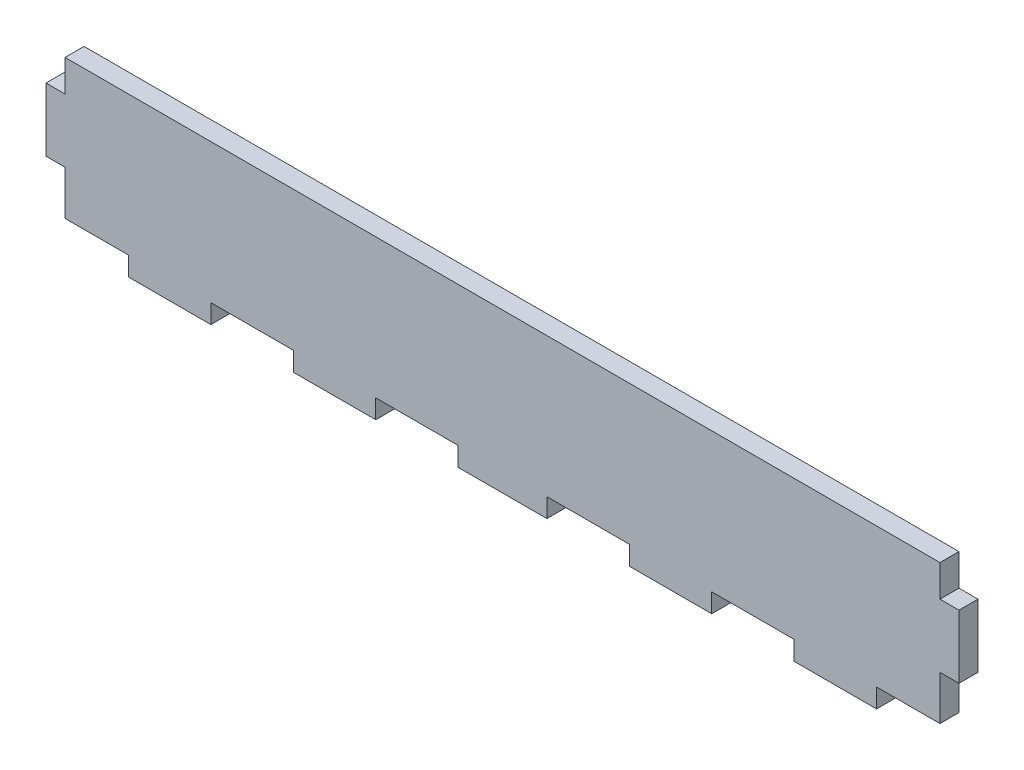
ISO-10303-21;
HEADER;
FILE_DESCRIPTION(('STEP AP214'),'2;1');
FILE_NAME('part.step','',(''),(''),'','','');
FILE_SCHEMA(('AUTOMOTIVE_DESIGN { 1 0 10303 214 1 1 1 1 }'));
ENDSEC;
DATA;
#1=APPLICATION_CONTEXT('core data for automotive mechanical design processes');
#2=APPLICATION_PROTOCOL_DEFINITION('international standard','automotive_design',2000,#1);
#3=PRODUCT_CONTEXT('',#1,'mechanical');
#4=PRODUCT('Part','Part','',(#3));
#5=PRODUCT_RELATED_PRODUCT_CATEGORY('part','',(#4));
#6=PRODUCT_DEFINITION_FORMATION('','',#4);
#7=PRODUCT_DEFINITION_CONTEXT('part definition',#1,'design');
#8=PRODUCT_DEFINITION('design','',#6,#7);
#9=PRODUCT_DEFINITION_SHAPE('','',#8);
#10=(LENGTH_UNIT() NAMED_UNIT(*) SI_UNIT(.MILLI.,.METRE.));
#11=(NAMED_UNIT(*) PLANE_ANGLE_UNIT() SI_UNIT($,.RADIAN.));
#12=(NAMED_UNIT(*) SI_UNIT($,.STERADIAN.) SOLID_ANGLE_UNIT());
#13=UNCERTAINTY_MEASURE_WITH_UNIT(LENGTH_MEASURE(1.E-05),#10,'distance_accuracy_value','');
#14=(GEOMETRIC_REPRESENTATION_CONTEXT(3) GLOBAL_UNCERTAINTY_ASSIGNED_CONTEXT((#13)) GLOBAL_UNIT_ASSIGNED_CONTEXT((#10,
#11,#12)) REPRESENTATION_CONTEXT('',''));
#15=CARTESIAN_POINT('',(0.,0.,0.));
#16=DIRECTION('',(0.,0.,1.));
#17=DIRECTION('',(1.,0.,0.));
#18=AXIS2_PLACEMENT_3D('',#15,#16,#17);
#19=CARTESIAN_POINT('',(0.,0.,3.));
#20=DIRECTION('',(1.,0.,0.));
#21=DIRECTION('',(0.,0.,-1.));
#22=AXIS2_PLACEMENT_3D('',#19,#20,#21);
#23=PLANE('',#22);
#24=DIRECTION('',(0.,-1.,0.));
#25=VECTOR('',#24,1.);
#26=CARTESIAN_POINT('',(0.,0.,0.));
#27=LINE('',#26,#25);
#28=CARTESIAN_POINT('',(0.,7.,0.));
#29=VERTEX_POINT('',#28);
#30=CARTESIAN_POINT('',(0.,0.,0.));
#31=VERTEX_POINT('',#30);
#32=EDGE_CURVE('E272',#29,#31,#27,.T.);
#33=ORIENTED_EDGE('',*,*,#32,.T.);
#34=DIRECTION('',(0.,0.,-1.));
#35=VECTOR('',#34,1.);
#36=CARTESIAN_POINT('',(0.,0.,3.));
#37=LINE('',#36,#35);
#38=CARTESIAN_POINT('',(0.,0.,3.));
#39=VERTEX_POINT('',#38);
#40=EDGE_CURVE('E11',#39,#31,#37,.T.);
#41=ORIENTED_EDGE('',*,*,#40,.F.);
#42=DIRECTION('',(0.,-1.,0.));
#43=VECTOR('',#42,1.);
#44=CARTESIAN_POINT('',(0.,0.,3.));
#45=LINE('',#44,#43);
#46=CARTESIAN_POINT('',(0.,7.,3.));
#47=VERTEX_POINT('',#46);
#48=EDGE_CURVE('E334',#47,#39,#45,.T.);
#49=ORIENTED_EDGE('',*,*,#48,.F.);
#50=DIRECTION('',(0.,0.,-1.));
#51=VECTOR('',#50,1.);
#52=CARTESIAN_POINT('',(0.,7.,3.));
#53=LINE('',#52,#51);
#54=EDGE_CURVE('E268',#47,#29,#53,.T.);
#55=ORIENTED_EDGE('',*,*,#54,.T.);
#56=EDGE_LOOP('',(#33,#41,#49,#55));
#57=FACE_BOUND('',#56,.T.);
#58=ADVANCED_FACE('F32',(#57),#23,.F.);
#59=CARTESIAN_POINT('',(0.,0.,3.));
#60=DIRECTION('',(0.,1.,0.));
#61=DIRECTION('',(0.,0.,1.));
#62=AXIS2_PLACEMENT_3D('',#59,#60,#61);
#63=PLANE('',#62);
#64=DIRECTION('',(1.,0.,0.));
#65=VECTOR('',#64,1.);
#66=CARTESIAN_POINT('',(0.,0.,0.));
#67=LINE('',#66,#65);
#68=CARTESIAN_POINT('',(10.,0.,0.));
#69=VERTEX_POINT('',#68);
#70=EDGE_CURVE('E275',#31,#69,#67,.T.);
#71=ORIENTED_EDGE('',*,*,#70,.T.);
#72=DIRECTION('',(0.,0.,-1.));
#73=VECTOR('',#72,1.);
#74=CARTESIAN_POINT('',(10.,0.,3.));
#75=LINE('',#74,#73);
#76=CARTESIAN_POINT('',(10.,0.,3.));
#77=VERTEX_POINT('',#76);
#78=EDGE_CURVE('E40',#77,#69,#75,.T.);
#79=ORIENTED_EDGE('',*,*,#78,.F.);
#80=DIRECTION('',(1.,0.,0.));
#81=VECTOR('',#80,1.);
#82=CARTESIAN_POINT('',(0.,0.,3.));
#83=LINE('',#82,#81);
#84=EDGE_CURVE('E163',#39,#77,#83,.T.);
#85=ORIENTED_EDGE('',*,*,#84,.F.);
#86=ORIENTED_EDGE('',*,*,#40,.T.);
#87=EDGE_LOOP('',(#71,#79,#85,#86));
#88=FACE_BOUND('',#87,.T.);
#89=ADVANCED_FACE('F512',(#88),#63,.F.);
#90=CARTESIAN_POINT('',(10.,0.,3.));
#91=DIRECTION('',(1.,0.,0.));
#92=DIRECTION('',(0.,0.,-1.));
#93=AXIS2_PLACEMENT_3D('',#90,#91,#92);
#94=PLANE('',#93);
#95=DIRECTION('',(0.,-1.,0.));
#96=VECTOR('',#95,1.);
#97=CARTESIAN_POINT('',(10.,0.,0.));
#98=LINE('',#97,#96);
#99=CARTESIAN_POINT('',(10.,-3.,0.));
#100=VERTEX_POINT('',#99);
#101=EDGE_CURVE('E277',#69,#100,#98,.T.);
#102=ORIENTED_EDGE('',*,*,#101,.T.);
#103=DIRECTION('',(0.,0.,-1.));
#104=VECTOR('',#103,1.);
#105=CARTESIAN_POINT('',(10.,-3.,3.));
#106=LINE('',#105,#104);
#107=CARTESIAN_POINT('',(10.,-3.,3.));
#108=VERTEX_POINT('',#107);
#109=EDGE_CURVE('E413',#108,#100,#106,.T.);
#110=ORIENTED_EDGE('',*,*,#109,.F.);
#111=DIRECTION('',(0.,-1.,0.));
#112=VECTOR('',#111,1.);
#113=CARTESIAN_POINT('',(10.,0.,3.));
#114=LINE('',#113,#112);
#115=EDGE_CURVE('E421',#77,#108,#114,.T.);
#116=ORIENTED_EDGE('',*,*,#115,.F.);
#117=ORIENTED_EDGE('',*,*,#78,.T.);
#118=EDGE_LOOP('',(#102,#110,#116,#117));
#119=FACE_BOUND('',#118,.T.);
#120=ADVANCED_FACE('F419',(#119),#94,.F.);
#121=CARTESIAN_POINT('',(10.,-3.,3.));
#122=DIRECTION('',(0.,1.,0.));
#123=DIRECTION('',(0.,0.,1.));
#124=AXIS2_PLACEMENT_3D('',#121,#122,#123);
#125=PLANE('',#124);
#126=DIRECTION('',(1.,0.,0.));
#127=VECTOR('',#126,1.);
#128=CARTESIAN_POINT('',(10.,-3.,0.));
#129=LINE('',#128,#127);
#130=CARTESIAN_POINT('',(23.,-3.,0.));
#131=VERTEX_POINT('',#130);
#132=EDGE_CURVE('E279',#100,#131,#129,.T.);
#133=ORIENTED_EDGE('',*,*,#132,.T.);
#134=DIRECTION('',(0.,0.,-1.));
#135=VECTOR('',#134,1.);
#136=CARTESIAN_POINT('',(23.,-3.,3.));
#137=LINE('',#136,#135);
#138=CARTESIAN_POINT('',(23.,-3.,3.));
#139=VERTEX_POINT('',#138);
#140=EDGE_CURVE('E410',#139,#131,#137,.T.);
#141=ORIENTED_EDGE('',*,*,#140,.F.);
#142=DIRECTION('',(1.,0.,0.));
#143=VECTOR('',#142,1.);
#144=CARTESIAN_POINT('',(10.,-3.,3.));
#145=LINE('',#144,#143);
#146=EDGE_CURVE('E439',#108,#139,#145,.T.);
#147=ORIENTED_EDGE('',*,*,#146,.F.);
#148=ORIENTED_EDGE('',*,*,#109,.T.);
#149=EDGE_LOOP('',(#133,#141,#147,#148));
#150=FACE_BOUND('',#149,.T.);
#151=ADVANCED_FACE('F430',(#150),#125,.F.);
#152=CARTESIAN_POINT('',(23.,0.,3.));
#153=DIRECTION('',(-1.,0.,0.));
#154=DIRECTION('',(0.,0.,1.));
#155=AXIS2_PLACEMENT_3D('',#152,#153,#154);
#156=PLANE('',#155);
#157=DIRECTION('',(0.,1.,0.));
#158=VECTOR('',#157,1.);
#159=CARTESIAN_POINT('',(23.,0.,0.));
#160=LINE('',#159,#158);
#161=CARTESIAN_POINT('',(23.,0.,0.));
#162=VERTEX_POINT('',#161);
#163=EDGE_CURVE('E281',#131,#162,#160,.T.);
#164=ORIENTED_EDGE('',*,*,#163,.T.);
#165=DIRECTION('',(0.,0.,-1.));
#166=VECTOR('',#165,1.);
#167=CARTESIAN_POINT('',(23.,0.,3.));
#168=LINE('',#167,#166);
#169=CARTESIAN_POINT('',(23.,0.,3.));
#170=VERTEX_POINT('',#169);
#171=EDGE_CURVE('E407',#170,#162,#168,.T.);
#172=ORIENTED_EDGE('',*,*,#171,.F.);
#173=DIRECTION('',(0.,1.,0.));
#174=VECTOR('',#173,1.);
#175=CARTESIAN_POINT('',(23.,0.,3.));
#176=LINE('',#175,#174);
#177=EDGE_CURVE('E436',#139,#170,#176,.T.);
#178=ORIENTED_EDGE('',*,*,#177,.F.);
#179=ORIENTED_EDGE('',*,*,#140,.T.);
#180=EDGE_LOOP('',(#164,#172,#178,#179));
#181=FACE_BOUND('',#180,.T.);
#182=ADVANCED_FACE('F434',(#181),#156,.F.);
#183=CARTESIAN_POINT('',(23.,0.,3.));
#184=DIRECTION('',(0.,1.,0.));
#185=DIRECTION('',(0.,0.,1.));
#186=AXIS2_PLACEMENT_3D('',#183,#184,#185);
#187=PLANE('',#186);
#188=DIRECTION('',(1.,0.,0.));
#189=VECTOR('',#188,1.);
#190=CARTESIAN_POINT('',(23.,0.,0.));
#191=LINE('',#190,#189);
#192=CARTESIAN_POINT('',(36.,0.,0.));
#193=VERTEX_POINT('',#192);
#194=EDGE_CURVE('E283',#162,#193,#191,.T.);
#195=ORIENTED_EDGE('',*,*,#194,.T.);
#196=DIRECTION('',(0.,0.,-1.));
#197=VECTOR('',#196,1.);
#198=CARTESIAN_POINT('',(36.,0.,3.));
#199=LINE('',#198,#197);
#200=CARTESIAN_POINT('',(36.,0.,3.));
#201=VERTEX_POINT('',#200);
#202=EDGE_CURVE('E404',#201,#193,#199,.T.);
#203=ORIENTED_EDGE('',*,*,#202,.F.);
#204=DIRECTION('',(1.,0.,0.));
#205=VECTOR('',#204,1.);
#206=CARTESIAN_POINT('',(23.,0.,3.));
#207=LINE('',#206,#205);
#208=EDGE_CURVE('E438',#170,#201,#207,.T.);
#209=ORIENTED_EDGE('',*,*,#208,.F.);
#210=ORIENTED_EDGE('',*,*,#171,.T.);
#211=EDGE_LOOP('',(#195,#203,#209,#210));
#212=FACE_BOUND('',#211,.T.);
#213=ADVANCED_FACE('F525',(#212),#187,.F.);
#214=CARTESIAN_POINT('',(36.,0.,3.));
#215=DIRECTION('',(1.,0.,0.));
#216=DIRECTION('',(0.,0.,-1.));
#217=AXIS2_PLACEMENT_3D('',#214,#215,#216);
#218=PLANE('',#217);
#219=DIRECTION('',(0.,-1.,0.));
#220=VECTOR('',#219,1.);
#221=CARTESIAN_POINT('',(36.,0.,0.));
#222=LINE('',#221,#220);
#223=CARTESIAN_POINT('',(36.,-3.,0.));
#224=VERTEX_POINT('',#223);
#225=EDGE_CURVE('E285',#193,#224,#222,.T.);
#226=ORIENTED_EDGE('',*,*,#225,.T.);
#227=DIRECTION('',(0.,0.,-1.));
#228=VECTOR('',#227,1.);
#229=CARTESIAN_POINT('',(36.,-3.,3.));
#230=LINE('',#229,#228);
#231=CARTESIAN_POINT('',(36.,-3.,3.));
#232=VERTEX_POINT('',#231);
#233=EDGE_CURVE('E401',#232,#224,#230,.T.);
#234=ORIENTED_EDGE('',*,*,#233,.F.);
#235=DIRECTION('',(0.,-1.,0.));
#236=VECTOR('',#235,1.);
#237=CARTESIAN_POINT('',(36.,0.,3.));
#238=LINE('',#237,#236);
#239=EDGE_CURVE('E441',#201,#232,#238,.T.);
#240=ORIENTED_EDGE('',*,*,#239,.F.);
#241=ORIENTED_EDGE('',*,*,#202,.T.);
#242=EDGE_LOOP('',(#226,#234,#240,#241));
#243=FACE_BOUND('',#242,.T.);
#244=ADVANCED_FACE('F528',(#243),#218,.F.);
#245=CARTESIAN_POINT('',(36.,-3.,3.));
#246=DIRECTION('',(0.,1.,0.));
#247=DIRECTION('',(0.,0.,1.));
#248=AXIS2_PLACEMENT_3D('',#245,#246,#247);
#249=PLANE('',#248);
#250=DIRECTION('',(1.,0.,0.));
#251=VECTOR('',#250,1.);
#252=CARTESIAN_POINT('',(36.,-3.,0.));
#253=LINE('',#252,#251);
#254=CARTESIAN_POINT('',(49.,-3.,0.));
#255=VERTEX_POINT('',#254);
#256=EDGE_CURVE('E287',#224,#255,#253,.T.);
#257=ORIENTED_EDGE('',*,*,#256,.T.);
#258=DIRECTION('',(0.,0.,-1.));
#259=VECTOR('',#258,1.);
#260=CARTESIAN_POINT('',(49.,-3.,3.));
#261=LINE('',#260,#259);
#262=CARTESIAN_POINT('',(49.,-3.,3.));
#263=VERTEX_POINT('',#262);
#264=EDGE_CURVE('E398',#263,#255,#261,.T.);
#265=ORIENTED_EDGE('',*,*,#264,.F.);
#266=DIRECTION('',(1.,0.,0.));
#267=VECTOR('',#266,1.);
#268=CARTESIAN_POINT('',(36.,-3.,3.));
#269=LINE('',#268,#267);
#270=EDGE_CURVE('E447',#232,#263,#269,.T.);
#271=ORIENTED_EDGE('',*,*,#270,.F.);
#272=ORIENTED_EDGE('',*,*,#233,.T.);
#273=EDGE_LOOP('',(#257,#265,#271,#272));
#274=FACE_BOUND('',#273,.T.);
#275=ADVANCED_FACE('F532',(#274),#249,.F.);
#276=CARTESIAN_POINT('',(49.,0.,3.));
#277=DIRECTION('',(-1.,0.,0.));
#278=DIRECTION('',(0.,0.,1.));
#279=AXIS2_PLACEMENT_3D('',#276,#277,#278);
#280=PLANE('',#279);
#281=DIRECTION('',(0.,1.,0.));
#282=VECTOR('',#281,1.);
#283=CARTESIAN_POINT('',(49.,0.,0.));
#284=LINE('',#283,#282);
#285=CARTESIAN_POINT('',(49.,0.,0.));
#286=VERTEX_POINT('',#285);
#287=EDGE_CURVE('E289',#255,#286,#284,.T.);
#288=ORIENTED_EDGE('',*,*,#287,.T.);
#289=DIRECTION('',(0.,0.,-1.));
#290=VECTOR('',#289,1.);
#291=CARTESIAN_POINT('',(49.,0.,3.));
#292=LINE('',#291,#290);
#293=CARTESIAN_POINT('',(49.,0.,3.));
#294=VERTEX_POINT('',#293);
#295=EDGE_CURVE('E395',#294,#286,#292,.T.);
#296=ORIENTED_EDGE('',*,*,#295,.F.);
#297=DIRECTION('',(0.,1.,0.));
#298=VECTOR('',#297,1.);
#299=CARTESIAN_POINT('',(49.,0.,3.));
#300=LINE('',#299,#298);
#301=EDGE_CURVE('E449',#263,#294,#300,.T.);
#302=ORIENTED_EDGE('',*,*,#301,.F.);
#303=ORIENTED_EDGE('',*,*,#264,.T.);
#304=EDGE_LOOP('',(#288,#296,#302,#303));
#305=FACE_BOUND('',#304,.T.);
#306=ADVANCED_FACE('F536',(#305),#280,.F.);
#307=CARTESIAN_POINT('',(49.,0.,3.));
#308=DIRECTION('',(0.,1.,0.));
#309=DIRECTION('',(0.,0.,1.));
#310=AXIS2_PLACEMENT_3D('',#307,#308,#309);
#311=PLANE('',#310);
#312=DIRECTION('',(1.,0.,0.));
#313=VECTOR('',#312,1.);
#314=CARTESIAN_POINT('',(49.,0.,0.));
#315=LINE('',#314,#313);
#316=CARTESIAN_POINT('',(62.,0.,0.));
#317=VERTEX_POINT('',#316);
#318=EDGE_CURVE('E291',#286,#317,#315,.T.);
#319=ORIENTED_EDGE('',*,*,#318,.T.);
#320=DIRECTION('',(0.,0.,-1.));
#321=VECTOR('',#320,1.);
#322=CARTESIAN_POINT('',(62.,0.,3.));
#323=LINE('',#322,#321);
#324=CARTESIAN_POINT('',(62.,0.,3.));
#325=VERTEX_POINT('',#324);
#326=EDGE_CURVE('E392',#325,#317,#323,.T.);
#327=ORIENTED_EDGE('',*,*,#326,.F.);
#328=DIRECTION('',(1.,0.,0.));
#329=VECTOR('',#328,1.);
#330=CARTESIAN_POINT('',(49.,0.,3.));
#331=LINE('',#330,#329);
#332=EDGE_CURVE('E451',#294,#325,#331,.T.);
#333=ORIENTED_EDGE('',*,*,#332,.F.);
#334=ORIENTED_EDGE('',*,*,#295,.T.);
#335=EDGE_LOOP('',(#319,#327,#333,#334));
#336=FACE_BOUND('',#335,.T.);
#337=ADVANCED_FACE('F540',(#336),#311,.F.);
#338=CARTESIAN_POINT('',(62.,0.,3.));
#339=DIRECTION('',(1.,0.,0.));
#340=DIRECTION('',(0.,0.,-1.));
#341=AXIS2_PLACEMENT_3D('',#338,#339,#340);
#342=PLANE('',#341);
#343=DIRECTION('',(0.,-1.,0.));
#344=VECTOR('',#343,1.);
#345=CARTESIAN_POINT('',(62.,0.,0.));
#346=LINE('',#345,#344);
#347=CARTESIAN_POINT('',(62.,-3.,0.));
#348=VERTEX_POINT('',#347);
#349=EDGE_CURVE('E293',#317,#348,#346,.T.);
#350=ORIENTED_EDGE('',*,*,#349,.T.);
#351=DIRECTION('',(0.,0.,-1.));
#352=VECTOR('',#351,1.);
#353=CARTESIAN_POINT('',(62.,-3.,3.));
#354=LINE('',#353,#352);
#355=CARTESIAN_POINT('',(62.,-3.,3.));
#356=VERTEX_POINT('',#355);
#357=EDGE_CURVE('E389',#356,#348,#354,.T.);
#358=ORIENTED_EDGE('',*,*,#357,.F.);
#359=DIRECTION('',(0.,-1.,0.));
#360=VECTOR('',#359,1.);
#361=CARTESIAN_POINT('',(62.,0.,3.));
#362=LINE('',#361,#360);
#363=EDGE_CURVE('E453',#325,#356,#362,.T.);
#364=ORIENTED_EDGE('',*,*,#363,.F.);
#365=ORIENTED_EDGE('',*,*,#326,.T.);
#366=EDGE_LOOP('',(#350,#358,#364,#365));
#367=FACE_BOUND('',#366,.T.);
#368=ADVANCED_FACE('F544',(#367),#342,.F.);
#369=CARTESIAN_POINT('',(62.,-3.,3.));
#370=DIRECTION('',(0.,1.,0.));
#371=DIRECTION('',(0.,0.,1.));
#372=AXIS2_PLACEMENT_3D('',#369,#370,#371);
#373=PLANE('',#372);
#374=DIRECTION('',(1.,0.,0.));
#375=VECTOR('',#374,1.);
#376=CARTESIAN_POINT('',(62.,-3.,0.));
#377=LINE('',#376,#375);
#378=CARTESIAN_POINT('',(76.,-3.,0.));
#379=VERTEX_POINT('',#378);
#380=EDGE_CURVE('E295',#348,#379,#377,.T.);
#381=ORIENTED_EDGE('',*,*,#380,.T.);
#382=DIRECTION('',(0.,0.,-1.));
#383=VECTOR('',#382,1.);
#384=CARTESIAN_POINT('',(76.,-3.,3.));
#385=LINE('',#384,#383);
#386=CARTESIAN_POINT('',(76.,-3.,3.));
#387=VERTEX_POINT('',#386);
#388=EDGE_CURVE('E386',#387,#379,#385,.T.);
#389=ORIENTED_EDGE('',*,*,#388,.F.);
#390=DIRECTION('',(1.,0.,0.));
#391=VECTOR('',#390,1.);
#392=CARTESIAN_POINT('',(62.,-3.,3.));
#393=LINE('',#392,#391);
#394=EDGE_CURVE('E455',#356,#387,#393,.T.);
#395=ORIENTED_EDGE('',*,*,#394,.F.);
#396=ORIENTED_EDGE('',*,*,#357,.T.);
#397=EDGE_LOOP('',(#381,#389,#395,#396));
#398=FACE_BOUND('',#397,.T.);
#399=ADVANCED_FACE('F548',(#398),#373,.F.);
#400=CARTESIAN_POINT('',(76.,0.,3.));
#401=DIRECTION('',(-1.,0.,0.));
#402=DIRECTION('',(0.,-1.,0.));
#403=AXIS2_PLACEMENT_3D('',#400,#401,#402);
#404=PLANE('',#403);
#405=DIRECTION('',(0.,1.,0.));
#406=VECTOR('',#405,1.);
#407=CARTESIAN_POINT('',(76.,0.,0.));
#408=LINE('',#407,#406);
#409=CARTESIAN_POINT('',(76.,0.,0.));
#410=VERTEX_POINT('',#409);
#411=EDGE_CURVE('E297',#379,#410,#408,.T.);
#412=ORIENTED_EDGE('',*,*,#411,.T.);
#413=DIRECTION('',(0.,0.,-1.));
#414=VECTOR('',#413,1.);
#415=CARTESIAN_POINT('',(76.,0.,3.));
#416=LINE('',#415,#414);
#417=CARTESIAN_POINT('',(76.,0.,3.));
#418=VERTEX_POINT('',#417);
#419=EDGE_CURVE('E383',#418,#410,#416,.T.);
#420=ORIENTED_EDGE('',*,*,#419,.F.);
#421=DIRECTION('',(0.,1.,0.));
#422=VECTOR('',#421,1.);
#423=CARTESIAN_POINT('',(76.,0.,3.));
#424=LINE('',#423,#422);
#425=EDGE_CURVE('E457',#387,#418,#424,.T.);
#426=ORIENTED_EDGE('',*,*,#425,.F.);
#427=ORIENTED_EDGE('',*,*,#388,.T.);
#428=EDGE_LOOP('',(#412,#420,#426,#427));
#429=FACE_BOUND('',#428,.T.);
#430=ADVANCED_FACE('F552',(#429),#404,.F.);
#431=CARTESIAN_POINT('',(76.,0.,3.));
#432=DIRECTION('',(0.,1.,0.));
#433=DIRECTION('',(0.,0.,1.));
#434=AXIS2_PLACEMENT_3D('',#431,#432,#433);
#435=PLANE('',#434);
#436=DIRECTION('',(1.,0.,0.));
#437=VECTOR('',#436,1.);
#438=CARTESIAN_POINT('',(76.,0.,0.));
#439=LINE('',#438,#437);
#440=CARTESIAN_POINT('',(89.,0.,0.));
#441=VERTEX_POINT('',#440);
#442=EDGE_CURVE('E299',#410,#441,#439,.T.);
#443=ORIENTED_EDGE('',*,*,#442,.T.);
#444=DIRECTION('',(0.,0.,-1.));
#445=VECTOR('',#444,1.);
#446=CARTESIAN_POINT('',(89.,0.,3.));
#447=LINE('',#446,#445);
#448=CARTESIAN_POINT('',(89.,0.,3.));
#449=VERTEX_POINT('',#448);
#450=EDGE_CURVE('E380',#449,#441,#447,.T.);
#451=ORIENTED_EDGE('',*,*,#450,.F.);
#452=DIRECTION('',(1.,0.,0.));
#453=VECTOR('',#452,1.);
#454=CARTESIAN_POINT('',(76.,0.,3.));
#455=LINE('',#454,#453);
#456=EDGE_CURVE('E459',#418,#449,#455,.T.);
#457=ORIENTED_EDGE('',*,*,#456,.F.);
#458=ORIENTED_EDGE('',*,*,#419,.T.);
#459=EDGE_LOOP('',(#443,#451,#457,#458));
#460=FACE_BOUND('',#459,.T.);
#461=ADVANCED_FACE('F556',(#460),#435,.F.);
#462=CARTESIAN_POINT('',(89.,0.,3.));
#463=DIRECTION('',(1.,0.,0.));
#464=DIRECTION('',(0.,0.,-1.));
#465=AXIS2_PLACEMENT_3D('',#462,#463,#464);
#466=PLANE('',#465);
#467=DIRECTION('',(0.,-1.,0.));
#468=VECTOR('',#467,1.);
#469=CARTESIAN_POINT('',(89.,0.,0.));
#470=LINE('',#469,#468);
#471=CARTESIAN_POINT('',(89.,-3.,0.));
#472=VERTEX_POINT('',#471);
#473=EDGE_CURVE('E301',#441,#472,#470,.T.);
#474=ORIENTED_EDGE('',*,*,#473,.T.);
#475=DIRECTION('',(0.,0.,-1.));
#476=VECTOR('',#475,1.);
#477=CARTESIAN_POINT('',(89.,-3.,3.));
#478=LINE('',#477,#476);
#479=CARTESIAN_POINT('',(89.,-3.,3.));
#480=VERTEX_POINT('',#479);
#481=EDGE_CURVE('E377',#480,#472,#478,.T.);
#482=ORIENTED_EDGE('',*,*,#481,.F.);
#483=DIRECTION('',(0.,-1.,0.));
#484=VECTOR('',#483,1.);
#485=CARTESIAN_POINT('',(89.,0.,3.));
#486=LINE('',#485,#484);
#487=EDGE_CURVE('E461',#449,#480,#486,.T.);
#488=ORIENTED_EDGE('',*,*,#487,.F.);
#489=ORIENTED_EDGE('',*,*,#450,.T.);
#490=EDGE_LOOP('',(#474,#482,#488,#489));
#491=FACE_BOUND('',#490,.T.);
#492=ADVANCED_FACE('F560',(#491),#466,.F.);
#493=CARTESIAN_POINT('',(89.,-3.,3.));
#494=DIRECTION('',(0.,1.,0.));
#495=DIRECTION('',(0.,0.,1.));
#496=AXIS2_PLACEMENT_3D('',#493,#494,#495);
#497=PLANE('',#496);
#498=DIRECTION('',(1.,0.,0.));
#499=VECTOR('',#498,1.);
#500=CARTESIAN_POINT('',(89.,-3.,0.));
#501=LINE('',#500,#499);
#502=CARTESIAN_POINT('',(102.,-3.,0.));
#503=VERTEX_POINT('',#502);
#504=EDGE_CURVE('E303',#472,#503,#501,.T.);
#505=ORIENTED_EDGE('',*,*,#504,.T.);
#506=DIRECTION('',(0.,0.,-1.));
#507=VECTOR('',#506,1.);
#508=CARTESIAN_POINT('',(102.,-3.,3.));
#509=LINE('',#508,#507);
#510=CARTESIAN_POINT('',(102.,-3.,3.));
#511=VERTEX_POINT('',#510);
#512=EDGE_CURVE('E374',#511,#503,#509,.T.);
#513=ORIENTED_EDGE('',*,*,#512,.F.);
#514=DIRECTION('',(1.,0.,0.));
#515=VECTOR('',#514,1.);
#516=CARTESIAN_POINT('',(89.,-3.,3.));
#517=LINE('',#516,#515);
#518=EDGE_CURVE('E463',#480,#511,#517,.T.);
#519=ORIENTED_EDGE('',*,*,#518,.F.);
#520=ORIENTED_EDGE('',*,*,#481,.T.);
#521=EDGE_LOOP('',(#505,#513,#519,#520));
#522=FACE_BOUND('',#521,.T.);
#523=ADVANCED_FACE('F564',(#522),#497,.F.);
#524=CARTESIAN_POINT('',(102.,0.,3.));
#525=DIRECTION('',(-1.,0.,0.));
#526=DIRECTION('',(0.,0.,1.));
#527=AXIS2_PLACEMENT_3D('',#524,#525,#526);
#528=PLANE('',#527);
#529=DIRECTION('',(0.,1.,0.));
#530=VECTOR('',#529,1.);
#531=CARTESIAN_POINT('',(102.,0.,0.));
#532=LINE('',#531,#530);
#533=CARTESIAN_POINT('',(102.,0.,0.));
#534=VERTEX_POINT('',#533);
#535=EDGE_CURVE('E305',#503,#534,#532,.T.);
#536=ORIENTED_EDGE('',*,*,#535,.T.);
#537=DIRECTION('',(0.,0.,-1.));
#538=VECTOR('',#537,1.);
#539=CARTESIAN_POINT('',(102.,0.,3.));
#540=LINE('',#539,#538);
#541=CARTESIAN_POINT('',(102.,0.,3.));
#542=VERTEX_POINT('',#541);
#543=EDGE_CURVE('E371',#542,#534,#540,.T.);
#544=ORIENTED_EDGE('',*,*,#543,.F.);
#545=DIRECTION('',(0.,1.,0.));
#546=VECTOR('',#545,1.);
#547=CARTESIAN_POINT('',(102.,0.,3.));
#548=LINE('',#547,#546);
#549=EDGE_CURVE('E465',#511,#542,#548,.T.);
#550=ORIENTED_EDGE('',*,*,#549,.F.);
#551=ORIENTED_EDGE('',*,*,#512,.T.);
#552=EDGE_LOOP('',(#536,#544,#550,#551));
#553=FACE_BOUND('',#552,.T.);
#554=ADVANCED_FACE('F568',(#553),#528,.F.);
#555=CARTESIAN_POINT('',(102.,0.,3.));
#556=DIRECTION('',(0.,1.,0.));
#557=DIRECTION('',(0.,0.,1.));
#558=AXIS2_PLACEMENT_3D('',#555,#556,#557);
#559=PLANE('',#558);
#560=DIRECTION('',(1.,0.,0.));
#561=VECTOR('',#560,1.);
#562=CARTESIAN_POINT('',(102.,0.,0.));
#563=LINE('',#562,#561);
#564=CARTESIAN_POINT('',(115.,0.,0.));
#565=VERTEX_POINT('',#564);
#566=EDGE_CURVE('E307',#534,#565,#563,.T.);
#567=ORIENTED_EDGE('',*,*,#566,.T.);
#568=DIRECTION('',(0.,0.,-1.));
#569=VECTOR('',#568,1.);
#570=CARTESIAN_POINT('',(115.,0.,3.));
#571=LINE('',#570,#569);
#572=CARTESIAN_POINT('',(115.,0.,3.));
#573=VERTEX_POINT('',#572);
#574=EDGE_CURVE('E368',#573,#565,#571,.T.);
#575=ORIENTED_EDGE('',*,*,#574,.F.);
#576=DIRECTION('',(1.,0.,0.));
#577=VECTOR('',#576,1.);
#578=CARTESIAN_POINT('',(102.,0.,3.));
#579=LINE('',#578,#577);
#580=EDGE_CURVE('E467',#542,#573,#579,.T.);
#581=ORIENTED_EDGE('',*,*,#580,.F.);
#582=ORIENTED_EDGE('',*,*,#543,.T.);
#583=EDGE_LOOP('',(#567,#575,#581,#582));
#584=FACE_BOUND('',#583,.T.);
#585=ADVANCED_FACE('F572',(#584),#559,.F.);
#586=CARTESIAN_POINT('',(115.,0.,3.));
#587=DIRECTION('',(1.,0.,0.));
#588=DIRECTION('',(0.,0.,-1.));
#589=AXIS2_PLACEMENT_3D('',#586,#587,#588);
#590=PLANE('',#589);
#591=DIRECTION('',(0.,-1.,0.));
#592=VECTOR('',#591,1.);
#593=CARTESIAN_POINT('',(115.,0.,0.));
#594=LINE('',#593,#592);
#595=CARTESIAN_POINT('',(115.,-3.,0.));
#596=VERTEX_POINT('',#595);
#597=EDGE_CURVE('E309',#565,#596,#594,.T.);
#598=ORIENTED_EDGE('',*,*,#597,.T.);
#599=DIRECTION('',(0.,0.,-1.));
#600=VECTOR('',#599,1.);
#601=CARTESIAN_POINT('',(115.,-3.,3.));
#602=LINE('',#601,#600);
#603=CARTESIAN_POINT('',(115.,-3.,3.));
#604=VERTEX_POINT('',#603);
#605=EDGE_CURVE('E365',#604,#596,#602,.T.);
#606=ORIENTED_EDGE('',*,*,#605,.F.);
#607=DIRECTION('',(0.,-1.,0.));
#608=VECTOR('',#607,1.);
#609=CARTESIAN_POINT('',(115.,0.,3.));
#610=LINE('',#609,#608);
#611=EDGE_CURVE('E469',#573,#604,#610,.T.);
#612=ORIENTED_EDGE('',*,*,#611,.F.);
#613=ORIENTED_EDGE('',*,*,#574,.T.);
#614=EDGE_LOOP('',(#598,#606,#612,#613));
#615=FACE_BOUND('',#614,.T.);
#616=ADVANCED_FACE('F576',(#615),#590,.F.);
#617=CARTESIAN_POINT('',(115.,-3.,3.));
#618=DIRECTION('',(0.,1.,0.));
#619=DIRECTION('',(0.,0.,1.));
#620=AXIS2_PLACEMENT_3D('',#617,#618,#619);
#621=PLANE('',#620);
#622=DIRECTION('',(1.,0.,0.));
#623=VECTOR('',#622,1.);
#624=CARTESIAN_POINT('',(115.,-3.,0.));
#625=LINE('',#624,#623);
#626=CARTESIAN_POINT('',(128.,-3.,0.));
#627=VERTEX_POINT('',#626);
#628=EDGE_CURVE('E311',#596,#627,#625,.T.);
#629=ORIENTED_EDGE('',*,*,#628,.T.);
#630=DIRECTION('',(0.,0.,-1.));
#631=VECTOR('',#630,1.);
#632=CARTESIAN_POINT('',(128.,-3.,3.));
#633=LINE('',#632,#631);
#634=CARTESIAN_POINT('',(128.,-3.,3.));
#635=VERTEX_POINT('',#634);
#636=EDGE_CURVE('E362',#635,#627,#633,.T.);
#637=ORIENTED_EDGE('',*,*,#636,.F.);
#638=DIRECTION('',(1.,0.,0.));
#639=VECTOR('',#638,1.);
#640=CARTESIAN_POINT('',(115.,-3.,3.));
#641=LINE('',#640,#639);
#642=EDGE_CURVE('E471',#604,#635,#641,.T.);
#643=ORIENTED_EDGE('',*,*,#642,.F.);
#644=ORIENTED_EDGE('',*,*,#605,.T.);
#645=EDGE_LOOP('',(#629,#637,#643,#644));
#646=FACE_BOUND('',#645,.T.);
#647=ADVANCED_FACE('F580',(#646),#621,.F.);
#648=CARTESIAN_POINT('',(128.,0.,3.));
#649=DIRECTION('',(-1.,0.,0.));
#650=DIRECTION('',(0.,0.,1.));
#651=AXIS2_PLACEMENT_3D('',#648,#649,#650);
#652=PLANE('',#651);
#653=DIRECTION('',(0.,1.,0.));
#654=VECTOR('',#653,1.);
#655=CARTESIAN_POINT('',(128.,0.,0.));
#656=LINE('',#655,#654);
#657=CARTESIAN_POINT('',(128.,0.,0.));
#658=VERTEX_POINT('',#657);
#659=EDGE_CURVE('E313',#627,#658,#656,.T.);
#660=ORIENTED_EDGE('',*,*,#659,.T.);
#661=DIRECTION('',(0.,0.,-1.));
#662=VECTOR('',#661,1.);
#663=CARTESIAN_POINT('',(128.,0.,3.));
#664=LINE('',#663,#662);
#665=CARTESIAN_POINT('',(128.,0.,3.));
#666=VERTEX_POINT('',#665);
#667=EDGE_CURVE('E359',#666,#658,#664,.T.);
#668=ORIENTED_EDGE('',*,*,#667,.F.);
#669=DIRECTION('',(0.,1.,0.));
#670=VECTOR('',#669,1.);
#671=CARTESIAN_POINT('',(128.,0.,3.));
#672=LINE('',#671,#670);
#673=EDGE_CURVE('E473',#635,#666,#672,.T.);
#674=ORIENTED_EDGE('',*,*,#673,.F.);
#675=ORIENTED_EDGE('',*,*,#636,.T.);
#676=EDGE_LOOP('',(#660,#668,#674,#675));
#677=FACE_BOUND('',#676,.T.);
#678=ADVANCED_FACE('F584',(#677),#652,.F.);
#679=CARTESIAN_POINT('',(128.,0.,3.));
#680=DIRECTION('',(0.,1.,0.));
#681=DIRECTION('',(0.,0.,1.));
#682=AXIS2_PLACEMENT_3D('',#679,#680,#681);
#683=PLANE('',#682);
#684=DIRECTION('',(1.,0.,0.));
#685=VECTOR('',#684,1.);
#686=CARTESIAN_POINT('',(128.,0.,0.));
#687=LINE('',#686,#685);
#688=CARTESIAN_POINT('',(138.,0.,0.));
#689=VERTEX_POINT('',#688);
#690=EDGE_CURVE('E315',#658,#689,#687,.T.);
#691=ORIENTED_EDGE('',*,*,#690,.T.);
#692=DIRECTION('',(0.,0.,-1.));
#693=VECTOR('',#692,1.);
#694=CARTESIAN_POINT('',(138.,0.,3.));
#695=LINE('',#694,#693);
#696=CARTESIAN_POINT('',(138.,0.,3.));
#697=VERTEX_POINT('',#696);
#698=EDGE_CURVE('E356',#697,#689,#695,.T.);
#699=ORIENTED_EDGE('',*,*,#698,.F.);
#700=DIRECTION('',(1.,0.,0.));
#701=VECTOR('',#700,1.);
#702=CARTESIAN_POINT('',(128.,0.,3.));
#703=LINE('',#702,#701);
#704=EDGE_CURVE('E475',#666,#697,#703,.T.);
#705=ORIENTED_EDGE('',*,*,#704,.F.);
#706=ORIENTED_EDGE('',*,*,#667,.T.);
#707=EDGE_LOOP('',(#691,#699,#705,#706));
#708=FACE_BOUND('',#707,.T.);
#709=ADVANCED_FACE('F588',(#708),#683,.F.);
#710=CARTESIAN_POINT('',(138.,0.,3.));
#711=DIRECTION('',(-1.,0.,0.));
#712=DIRECTION('',(0.,0.,1.));
#713=AXIS2_PLACEMENT_3D('',#710,#711,#712);
#714=PLANE('',#713);
#715=DIRECTION('',(0.,1.,0.));
#716=VECTOR('',#715,1.);
#717=CARTESIAN_POINT('',(138.,0.,0.));
#718=LINE('',#717,#716);
#719=CARTESIAN_POINT('',(138.,7.00000000000002,0.));
#720=VERTEX_POINT('',#719);
#721=EDGE_CURVE('E317',#689,#720,#718,.T.);
#722=ORIENTED_EDGE('',*,*,#721,.T.);
#723=DIRECTION('',(0.,0.,-1.));
#724=VECTOR('',#723,1.);
#725=CARTESIAN_POINT('',(138.,7.00000000000002,3.));
#726=LINE('',#725,#724);
#727=CARTESIAN_POINT('',(138.,7.00000000000002,3.));
#728=VERTEX_POINT('',#727);
#729=EDGE_CURVE('E353',#728,#720,#726,.T.);
#730=ORIENTED_EDGE('',*,*,#729,.F.);
#731=DIRECTION('',(0.,1.,0.));
#732=VECTOR('',#731,1.);
#733=CARTESIAN_POINT('',(138.,0.,3.));
#734=LINE('',#733,#732);
#735=EDGE_CURVE('E477',#697,#728,#734,.T.);
#736=ORIENTED_EDGE('',*,*,#735,.F.);
#737=ORIENTED_EDGE('',*,*,#698,.T.);
#738=EDGE_LOOP('',(#722,#730,#736,#737));
#739=FACE_BOUND('',#738,.T.);
#740=ADVANCED_FACE('F592',(#739),#714,.F.);
#741=CARTESIAN_POINT('',(138.,7.00000000000002,3.));
#742=DIRECTION('',(0.,1.,0.));
#743=DIRECTION('',(0.,0.,1.));
#744=AXIS2_PLACEMENT_3D('',#741,#742,#743);
#745=PLANE('',#744);
#746=DIRECTION('',(1.,0.,0.));
#747=VECTOR('',#746,1.);
#748=CARTESIAN_POINT('',(138.,7.00000000000002,0.));
#749=LINE('',#748,#747);
#750=CARTESIAN_POINT('',(141.,7.00000000000002,0.));
#751=VERTEX_POINT('',#750);
#752=EDGE_CURVE('E319',#720,#751,#749,.T.);
#753=ORIENTED_EDGE('',*,*,#752,.T.);
#754=DIRECTION('',(0.,0.,-1.));
#755=VECTOR('',#754,1.);
#756=CARTESIAN_POINT('',(141.,7.00000000000002,3.));
#757=LINE('',#756,#755);
#758=CARTESIAN_POINT('',(141.,7.00000000000002,3.));
#759=VERTEX_POINT('',#758);
#760=EDGE_CURVE('E350',#759,#751,#757,.T.);
#761=ORIENTED_EDGE('',*,*,#760,.F.);
#762=DIRECTION('',(1.,0.,0.));
#763=VECTOR('',#762,1.);
#764=CARTESIAN_POINT('',(138.,7.00000000000002,3.));
#765=LINE('',#764,#763);
#766=EDGE_CURVE('E479',#728,#759,#765,.T.);
#767=ORIENTED_EDGE('',*,*,#766,.F.);
#768=ORIENTED_EDGE('',*,*,#729,.T.);
#769=EDGE_LOOP('',(#753,#761,#767,#768));
#770=FACE_BOUND('',#769,.T.);
#771=ADVANCED_FACE('F596',(#770),#745,.F.);
#772=CARTESIAN_POINT('',(141.,17.,3.));
#773=DIRECTION('',(-1.,0.,0.));
#774=DIRECTION('',(0.,0.,1.));
#775=AXIS2_PLACEMENT_3D('',#772,#773,#774);
#776=PLANE('',#775);
#777=DIRECTION('',(0.,1.,0.));
#778=VECTOR('',#777,1.);
#779=CARTESIAN_POINT('',(141.,17.,0.));
#780=LINE('',#779,#778);
#781=CARTESIAN_POINT('',(141.,17.,0.));
#782=VERTEX_POINT('',#781);
#783=EDGE_CURVE('E321',#751,#782,#780,.T.);
#784=ORIENTED_EDGE('',*,*,#783,.T.);
#785=DIRECTION('',(0.,0.,-1.));
#786=VECTOR('',#785,1.);
#787=CARTESIAN_POINT('',(141.,17.,3.));
#788=LINE('',#787,#786);
#789=CARTESIAN_POINT('',(141.,17.,3.));
#790=VERTEX_POINT('',#789);
#791=EDGE_CURVE('E347',#790,#782,#788,.T.);
#792=ORIENTED_EDGE('',*,*,#791,.F.);
#793=DIRECTION('',(0.,1.,0.));
#794=VECTOR('',#793,1.);
#795=CARTESIAN_POINT('',(141.,17.,3.));
#796=LINE('',#795,#794);
#797=EDGE_CURVE('E481',#759,#790,#796,.T.);
#798=ORIENTED_EDGE('',*,*,#797,.F.);
#799=ORIENTED_EDGE('',*,*,#760,.T.);
#800=EDGE_LOOP('',(#784,#792,#798,#799));
#801=FACE_BOUND('',#800,.T.);
#802=ADVANCED_FACE('F600',(#801),#776,.F.);
#803=CARTESIAN_POINT('',(138.,17.,3.));
#804=DIRECTION('',(0.,-1.,0.));
#805=DIRECTION('',(1.,0.,0.));
#806=AXIS2_PLACEMENT_3D('',#803,#804,#805);
#807=PLANE('',#806);
#808=DIRECTION('',(-1.,0.,0.));
#809=VECTOR('',#808,1.);
#810=CARTESIAN_POINT('',(138.,17.,0.));
#811=LINE('',#810,#809);
#812=CARTESIAN_POINT('',(138.,17.,0.));
#813=VERTEX_POINT('',#812);
#814=EDGE_CURVE('E323',#782,#813,#811,.T.);
#815=ORIENTED_EDGE('',*,*,#814,.T.);
#816=DIRECTION('',(0.,0.,-1.));
#817=VECTOR('',#816,1.);
#818=CARTESIAN_POINT('',(138.,17.,3.));
#819=LINE('',#818,#817);
#820=CARTESIAN_POINT('',(138.,17.,3.));
#821=VERTEX_POINT('',#820);
#822=EDGE_CURVE('E344',#821,#813,#819,.T.);
#823=ORIENTED_EDGE('',*,*,#822,.F.);
#824=DIRECTION('',(-1.,0.,0.));
#825=VECTOR('',#824,1.);
#826=CARTESIAN_POINT('',(138.,17.,3.));
#827=LINE('',#826,#825);
#828=EDGE_CURVE('E483',#790,#821,#827,.T.);
#829=ORIENTED_EDGE('',*,*,#828,.F.);
#830=ORIENTED_EDGE('',*,*,#791,.T.);
#831=EDGE_LOOP('',(#815,#823,#829,#830));
#832=FACE_BOUND('',#831,.T.);
#833=ADVANCED_FACE('F604',(#832),#807,.F.);
#834=CARTESIAN_POINT('',(138.,17.,3.));
#835=DIRECTION('',(-1.,0.,0.));
#836=DIRECTION('',(0.,0.,1.));
#837=AXIS2_PLACEMENT_3D('',#834,#835,#836);
#838=PLANE('',#837);
#839=DIRECTION('',(0.,1.,0.));
#840=VECTOR('',#839,1.);
#841=CARTESIAN_POINT('',(138.,17.,0.));
#842=LINE('',#841,#840);
#843=CARTESIAN_POINT('',(138.,22.,0.));
#844=VERTEX_POINT('',#843);
#845=EDGE_CURVE('E325',#813,#844,#842,.T.);
#846=ORIENTED_EDGE('',*,*,#845,.T.);
#847=DIRECTION('',(0.,0.,-1.));
#848=VECTOR('',#847,1.);
#849=CARTESIAN_POINT('',(138.,22.,3.));
#850=LINE('',#849,#848);
#851=CARTESIAN_POINT('',(138.,22.,3.));
#852=VERTEX_POINT('',#851);
#853=EDGE_CURVE('E341',#852,#844,#850,.T.);
#854=ORIENTED_EDGE('',*,*,#853,.F.);
#855=DIRECTION('',(0.,1.,0.));
#856=VECTOR('',#855,1.);
#857=CARTESIAN_POINT('',(138.,17.,3.));
#858=LINE('',#857,#856);
#859=EDGE_CURVE('E485',#821,#852,#858,.T.);
#860=ORIENTED_EDGE('',*,*,#859,.F.);
#861=ORIENTED_EDGE('',*,*,#822,.T.);
#862=EDGE_LOOP('',(#846,#854,#860,#861));
#863=FACE_BOUND('',#862,.T.);
#864=ADVANCED_FACE('F608',(#863),#838,.F.);
#865=CARTESIAN_POINT('',(0.,22.,3.));
#866=DIRECTION('',(0.,-1.,0.));
#867=DIRECTION('',(0.,0.,-1.));
#868=AXIS2_PLACEMENT_3D('',#865,#866,#867);
#869=PLANE('',#868);
#870=DIRECTION('',(-1.,0.,0.));
#871=VECTOR('',#870,1.);
#872=CARTESIAN_POINT('',(0.,22.,0.));
#873=LINE('',#872,#871);
#874=CARTESIAN_POINT('',(0.,22.,0.));
#875=VERTEX_POINT('',#874);
#876=EDGE_CURVE('E327',#844,#875,#873,.T.);
#877=ORIENTED_EDGE('',*,*,#876,.T.);
#878=DIRECTION('',(0.,0.,-1.));
#879=VECTOR('',#878,1.);
#880=CARTESIAN_POINT('',(0.,22.,3.));
#881=LINE('',#880,#879);
#882=CARTESIAN_POINT('',(0.,22.,3.));
#883=VERTEX_POINT('',#882);
#884=EDGE_CURVE('E338',#883,#875,#881,.T.);
#885=ORIENTED_EDGE('',*,*,#884,.F.);
#886=DIRECTION('',(-1.,0.,0.));
#887=VECTOR('',#886,1.);
#888=CARTESIAN_POINT('',(0.,22.,3.));
#889=LINE('',#888,#887);
#890=EDGE_CURVE('E487',#852,#883,#889,.T.);
#891=ORIENTED_EDGE('',*,*,#890,.F.);
#892=ORIENTED_EDGE('',*,*,#853,.T.);
#893=EDGE_LOOP('',(#877,#885,#891,#892));
#894=FACE_BOUND('',#893,.T.);
#895=ADVANCED_FACE('F493',(#894),#869,.F.);
#896=CARTESIAN_POINT('',(0.,17.,3.));
#897=DIRECTION('',(1.,0.,0.));
#898=DIRECTION('',(0.,0.,-1.));
#899=AXIS2_PLACEMENT_3D('',#896,#897,#898);
#900=PLANE('',#899);
#901=DIRECTION('',(0.,-1.,0.));
#902=VECTOR('',#901,1.);
#903=CARTESIAN_POINT('',(0.,17.,0.));
#904=LINE('',#903,#902);
#905=CARTESIAN_POINT('',(0.,17.,0.));
#906=VERTEX_POINT('',#905);
#907=EDGE_CURVE('E329',#875,#906,#904,.T.);
#908=ORIENTED_EDGE('',*,*,#907,.T.);
#909=DIRECTION('',(0.,0.,-1.));
#910=VECTOR('',#909,1.);
#911=CARTESIAN_POINT('',(0.,17.,3.));
#912=LINE('',#911,#910);
#913=CARTESIAN_POINT('',(0.,17.,3.));
#914=VERTEX_POINT('',#913);
#915=EDGE_CURVE('E263',#914,#906,#912,.T.);
#916=ORIENTED_EDGE('',*,*,#915,.F.);
#917=DIRECTION('',(0.,-1.,0.));
#918=VECTOR('',#917,1.);
#919=CARTESIAN_POINT('',(0.,17.,3.));
#920=LINE('',#919,#918);
#921=EDGE_CURVE('E254',#883,#914,#920,.T.);
#922=ORIENTED_EDGE('',*,*,#921,.F.);
#923=ORIENTED_EDGE('',*,*,#884,.T.);
#924=EDGE_LOOP('',(#908,#916,#922,#923));
#925=FACE_BOUND('',#924,.T.);
#926=ADVANCED_FACE('F497',(#925),#900,.F.);
#927=CARTESIAN_POINT('',(0.,17.,3.));
#928=DIRECTION('',(0.,-1.,0.));
#929=DIRECTION('',(0.,0.,-1.));
#930=AXIS2_PLACEMENT_3D('',#927,#928,#929);
#931=PLANE('',#930);
#932=DIRECTION('',(-1.,0.,0.));
#933=VECTOR('',#932,1.);
#934=CARTESIAN_POINT('',(0.,17.,0.));
#935=LINE('',#934,#933);
#936=CARTESIAN_POINT('',(-3.,17.,0.));
#937=VERTEX_POINT('',#936);
#938=EDGE_CURVE('E262',#906,#937,#935,.T.);
#939=ORIENTED_EDGE('',*,*,#938,.T.);
#940=DIRECTION('',(0.,0.,-1.));
#941=VECTOR('',#940,1.);
#942=CARTESIAN_POINT('',(-3.,17.,3.));
#943=LINE('',#942,#941);
#944=CARTESIAN_POINT('',(-3.,17.,3.));
#945=VERTEX_POINT('',#944);
#946=EDGE_CURVE('E259',#945,#937,#943,.T.);
#947=ORIENTED_EDGE('',*,*,#946,.F.);
#948=DIRECTION('',(-1.,0.,0.));
#949=VECTOR('',#948,1.);
#950=CARTESIAN_POINT('',(0.,17.,3.));
#951=LINE('',#950,#949);
#952=EDGE_CURVE('E248',#914,#945,#951,.T.);
#953=ORIENTED_EDGE('',*,*,#952,.F.);
#954=ORIENTED_EDGE('',*,*,#915,.T.);
#955=EDGE_LOOP('',(#939,#947,#953,#954));
#956=FACE_BOUND('',#955,.T.);
#957=ADVANCED_FACE('F260',(#956),#931,.F.);
#958=CARTESIAN_POINT('',(-3.,17.,3.));
#959=DIRECTION('',(1.,0.,0.));
#960=DIRECTION('',(0.,1.,0.));
#961=AXIS2_PLACEMENT_3D('',#958,#959,#960);
#962=PLANE('',#961);
#963=DIRECTION('',(0.,-1.,0.));
#964=VECTOR('',#963,1.);
#965=CARTESIAN_POINT('',(-3.,17.,0.));
#966=LINE('',#965,#964);
#967=CARTESIAN_POINT('',(-3.,7.,0.));
#968=VERTEX_POINT('',#967);
#969=EDGE_CURVE('E149',#937,#968,#966,.T.);
#970=ORIENTED_EDGE('',*,*,#969,.T.);
#971=DIRECTION('',(0.,0.,-1.));
#972=VECTOR('',#971,1.);
#973=CARTESIAN_POINT('',(-3.,7.,3.));
#974=LINE('',#973,#972);
#975=CARTESIAN_POINT('',(-3.,7.,3.));
#976=VERTEX_POINT('',#975);
#977=EDGE_CURVE('E264',#976,#968,#974,.T.);
#978=ORIENTED_EDGE('',*,*,#977,.F.);
#979=DIRECTION('',(0.,-1.,0.));
#980=VECTOR('',#979,1.);
#981=CARTESIAN_POINT('',(-3.,17.,3.));
#982=LINE('',#981,#980);
#983=EDGE_CURVE('E252',#945,#976,#982,.T.);
#984=ORIENTED_EDGE('',*,*,#983,.F.);
#985=ORIENTED_EDGE('',*,*,#946,.T.);
#986=EDGE_LOOP('',(#970,#978,#984,#985));
#987=FACE_BOUND('',#986,.T.);
#988=ADVANCED_FACE('F266',(#987),#962,.F.);
#989=CARTESIAN_POINT('',(0.,7.,3.));
#990=DIRECTION('',(0.,1.,0.));
#991=DIRECTION('',(0.,0.,1.));
#992=AXIS2_PLACEMENT_3D('',#989,#990,#991);
#993=PLANE('',#992);
#994=DIRECTION('',(1.,0.,0.));
#995=VECTOR('',#994,1.);
#996=CARTESIAN_POINT('',(0.,7.,0.));
#997=LINE('',#996,#995);
#998=EDGE_CURVE('E155',#968,#29,#997,.T.);
#999=ORIENTED_EDGE('',*,*,#998,.T.);
#1000=ORIENTED_EDGE('',*,*,#54,.F.);
#1001=DIRECTION('',(1.,0.,0.));
#1002=VECTOR('',#1001,1.);
#1003=CARTESIAN_POINT('',(0.,7.,3.));
#1004=LINE('',#1003,#1002);
#1005=EDGE_CURVE('E48',#976,#47,#1004,.T.);
#1006=ORIENTED_EDGE('',*,*,#1005,.F.);
#1007=ORIENTED_EDGE('',*,*,#977,.T.);
#1008=EDGE_LOOP('',(#999,#1000,#1006,#1007));
#1009=FACE_BOUND('',#1008,.T.);
#1010=ADVANCED_FACE('F501',(#1009),#993,.F.);
#1011=CARTESIAN_POINT('',(0.,0.,3.));
#1012=DIRECTION('',(0.,0.,1.));
#1013=DIRECTION('',(1.,0.,0.));
#1014=AXIS2_PLACEMENT_3D('',#1011,#1012,#1013);
#1015=PLANE('',#1014);
#1016=ORIENTED_EDGE('',*,*,#48,.T.);
#1017=ORIENTED_EDGE('',*,*,#84,.T.);
#1018=ORIENTED_EDGE('',*,*,#115,.T.);
#1019=ORIENTED_EDGE('',*,*,#146,.T.);
#1020=ORIENTED_EDGE('',*,*,#177,.T.);
#1021=ORIENTED_EDGE('',*,*,#208,.T.);
#1022=ORIENTED_EDGE('',*,*,#239,.T.);
#1023=ORIENTED_EDGE('',*,*,#270,.T.);
#1024=ORIENTED_EDGE('',*,*,#301,.T.);
#1025=ORIENTED_EDGE('',*,*,#332,.T.);
#1026=ORIENTED_EDGE('',*,*,#363,.T.);
#1027=ORIENTED_EDGE('',*,*,#394,.T.);
#1028=ORIENTED_EDGE('',*,*,#425,.T.);
#1029=ORIENTED_EDGE('',*,*,#456,.T.);
#1030=ORIENTED_EDGE('',*,*,#487,.T.);
#1031=ORIENTED_EDGE('',*,*,#518,.T.);
#1032=ORIENTED_EDGE('',*,*,#549,.T.);
#1033=ORIENTED_EDGE('',*,*,#580,.T.);
#1034=ORIENTED_EDGE('',*,*,#611,.T.);
#1035=ORIENTED_EDGE('',*,*,#642,.T.);
#1036=ORIENTED_EDGE('',*,*,#673,.T.);
#1037=ORIENTED_EDGE('',*,*,#704,.T.);
#1038=ORIENTED_EDGE('',*,*,#735,.T.);
#1039=ORIENTED_EDGE('',*,*,#766,.T.);
#1040=ORIENTED_EDGE('',*,*,#797,.T.);
#1041=ORIENTED_EDGE('',*,*,#828,.T.);
#1042=ORIENTED_EDGE('',*,*,#859,.T.);
#1043=ORIENTED_EDGE('',*,*,#890,.T.);
#1044=ORIENTED_EDGE('',*,*,#921,.T.);
#1045=ORIENTED_EDGE('',*,*,#952,.T.);
#1046=ORIENTED_EDGE('',*,*,#983,.T.);
#1047=ORIENTED_EDGE('',*,*,#1005,.T.);
#1048=EDGE_LOOP('',(#1016,#1017,#1018,#1019,#1020,#1021,#1022,#1023,#1024,#1025,#1026,#1027,
#1028,#1029,#1030,#1031,#1032,#1033,#1034,#1035,#1036,#1037,#1038,#1039,#1040,#1041,#1042,#1043,
#1044,#1045,#1046,#1047));
#1049=FACE_BOUND('',#1048,.T.);
#1050=ADVANCED_FACE('F250',(#1049),#1015,.T.);
#1051=CARTESIAN_POINT('',(0.,0.,0.));
#1052=DIRECTION('',(0.,0.,1.));
#1053=DIRECTION('',(1.,0.,0.));
#1054=AXIS2_PLACEMENT_3D('',#1051,#1052,#1053);
#1055=PLANE('',#1054);
#1056=ORIENTED_EDGE('',*,*,#32,.F.);
#1057=ORIENTED_EDGE('',*,*,#998,.F.);
#1058=ORIENTED_EDGE('',*,*,#969,.F.);
#1059=ORIENTED_EDGE('',*,*,#938,.F.);
#1060=ORIENTED_EDGE('',*,*,#907,.F.);
#1061=ORIENTED_EDGE('',*,*,#876,.F.);
#1062=ORIENTED_EDGE('',*,*,#845,.F.);
#1063=ORIENTED_EDGE('',*,*,#814,.F.);
#1064=ORIENTED_EDGE('',*,*,#783,.F.);
#1065=ORIENTED_EDGE('',*,*,#752,.F.);
#1066=ORIENTED_EDGE('',*,*,#721,.F.);
#1067=ORIENTED_EDGE('',*,*,#690,.F.);
#1068=ORIENTED_EDGE('',*,*,#659,.F.);
#1069=ORIENTED_EDGE('',*,*,#628,.F.);
#1070=ORIENTED_EDGE('',*,*,#597,.F.);
#1071=ORIENTED_EDGE('',*,*,#566,.F.);
#1072=ORIENTED_EDGE('',*,*,#535,.F.);
#1073=ORIENTED_EDGE('',*,*,#504,.F.);
#1074=ORIENTED_EDGE('',*,*,#473,.F.);
#1075=ORIENTED_EDGE('',*,*,#442,.F.);
#1076=ORIENTED_EDGE('',*,*,#411,.F.);
#1077=ORIENTED_EDGE('',*,*,#380,.F.);
#1078=ORIENTED_EDGE('',*,*,#349,.F.);
#1079=ORIENTED_EDGE('',*,*,#318,.F.);
#1080=ORIENTED_EDGE('',*,*,#287,.F.);
#1081=ORIENTED_EDGE('',*,*,#256,.F.);
#1082=ORIENTED_EDGE('',*,*,#225,.F.);
#1083=ORIENTED_EDGE('',*,*,#194,.F.);
#1084=ORIENTED_EDGE('',*,*,#163,.F.);
#1085=ORIENTED_EDGE('',*,*,#132,.F.);
#1086=ORIENTED_EDGE('',*,*,#101,.F.);
#1087=ORIENTED_EDGE('',*,*,#70,.F.);
#1088=EDGE_LOOP('',(#1056,#1057,#1058,#1059,#1060,#1061,#1062,#1063,#1064,#1065,#1066,#1067,
#1068,#1069,#1070,#1071,#1072,#1073,#1074,#1075,#1076,#1077,#1078,#1079,#1080,#1081,#1082,#1083,
#1084,#1085,#1086,#1087));
#1089=FACE_BOUND('',#1088,.T.);
#1090=ADVANCED_FACE('F425',(#1089),#1055,.F.);
#1091=CLOSED_SHELL('',(#58,#89,#120,#151,#182,#213,#244,#275,#306,#337,#368,#399,#430,#461,#492,
#523,#554,#585,#616,#647,#678,#709,#740,#771,#802,#833,#864,#895,#926,#957,#988,#1010,#1050,#1090));
#1092=MANIFOLD_SOLID_BREP('B2',#1091);
#1093=ADVANCED_BREP_SHAPE_REPRESENTATION('',(#18,#1092),#14);
#1094=SHAPE_DEFINITION_REPRESENTATION(#9,#1093);
ENDSEC;
END-ISO-10303-21;
